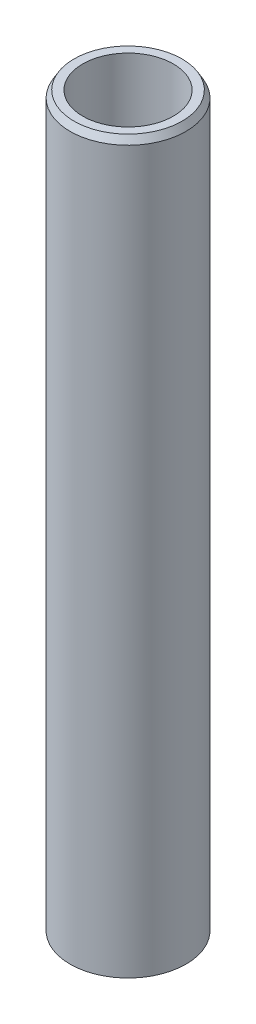
ISO-10303-21;
HEADER;
FILE_DESCRIPTION(('STEP AP214'),'2;1');
FILE_NAME('part.step','',(''),(''),'','','');
FILE_SCHEMA(('AUTOMOTIVE_DESIGN { 1 0 10303 214 1 1 1 1 }'));
ENDSEC;
DATA;
#1=APPLICATION_CONTEXT('core data for automotive mechanical design processes');
#2=APPLICATION_PROTOCOL_DEFINITION('international standard','automotive_design',2000,#1);
#3=PRODUCT_CONTEXT('',#1,'mechanical');
#4=PRODUCT('Part','Part','',(#3));
#5=PRODUCT_RELATED_PRODUCT_CATEGORY('part','',(#4));
#6=PRODUCT_DEFINITION_FORMATION('','',#4);
#7=PRODUCT_DEFINITION_CONTEXT('part definition',#1,'design');
#8=PRODUCT_DEFINITION('design','',#6,#7);
#9=PRODUCT_DEFINITION_SHAPE('','',#8);
#10=(LENGTH_UNIT() NAMED_UNIT(*) SI_UNIT(.MILLI.,.METRE.));
#11=(NAMED_UNIT(*) PLANE_ANGLE_UNIT() SI_UNIT($,.RADIAN.));
#12=(NAMED_UNIT(*) SI_UNIT($,.STERADIAN.) SOLID_ANGLE_UNIT());
#13=UNCERTAINTY_MEASURE_WITH_UNIT(LENGTH_MEASURE(1.E-05),#10,'distance_accuracy_value','');
#14=(GEOMETRIC_REPRESENTATION_CONTEXT(3) GLOBAL_UNCERTAINTY_ASSIGNED_CONTEXT((#13)) GLOBAL_UNIT_ASSIGNED_CONTEXT((#10,
#11,#12)) REPRESENTATION_CONTEXT('',''));
#15=CARTESIAN_POINT('',(0.,0.,0.));
#16=DIRECTION('',(0.,0.,1.));
#17=DIRECTION('',(1.,0.,0.));
#18=AXIS2_PLACEMENT_3D('',#15,#16,#17);
#19=CARTESIAN_POINT('',(0.,600.,0.));
#20=DIRECTION('',(0.,-1.,0.));
#21=DIRECTION('',(0.,0.,-1.));
#22=AXIS2_PLACEMENT_3D('',#19,#20,#21);
#23=CYLINDRICAL_SURFACE('',#22,47.5);
#24=CARTESIAN_POINT('',(0.,594.374029950717,0.));
#25=DIRECTION('',(0.,1.,0.));
#26=DIRECTION('',(0.,0.,1.));
#27=AXIS2_PLACEMENT_3D('',#24,#25,#26);
#28=CIRCLE('',#27,47.5);
#29=CARTESIAN_POINT('',(0.,594.374029950717,-47.5));
#30=VERTEX_POINT('',#29);
#31=EDGE_CURVE('E50',#30,#30,#28,.F.);
#32=CARTESIAN_POINT('',(0.,3.24815532240608,0.));
#33=DIRECTION('',(0.,1.,0.));
#34=DIRECTION('',(0.,0.,1.));
#35=AXIS2_PLACEMENT_3D('',#32,#33,#34);
#36=CIRCLE('',#35,47.5);
#37=CARTESIAN_POINT('',(0.,3.24815532240608,-47.5));
#38=VERTEX_POINT('',#37);
#39=EDGE_CURVE('E51',#38,#38,#36,.T.);
#40=CARTESIAN_POINT('',(0.,594.374029950717,-47.5));
#41=CARTESIAN_POINT('',(0.,588.216468756672,-47.5));
#42=CARTESIAN_POINT('',(0.,582.058907562628,-47.5));
#43=CARTESIAN_POINT('',(0.,569.743785174538,-47.5));
#44=CARTESIAN_POINT('',(0.,563.586223980493,-47.5));
#45=CARTESIAN_POINT('',(0.,551.271101592403,-47.5));
#46=CARTESIAN_POINT('',(0.,545.113540398358,-47.5));
#47=CARTESIAN_POINT('',(0.,532.798418010268,-47.5));
#48=CARTESIAN_POINT('',(0.,526.640856816223,-47.5));
#49=CARTESIAN_POINT('',(0.,514.325734428134,-47.5));
#50=CARTESIAN_POINT('',(0.,508.168173234089,-47.5));
#51=CARTESIAN_POINT('',(0.,495.853050845999,-47.5));
#52=CARTESIAN_POINT('',(0.,489.695489651954,-47.5));
#53=CARTESIAN_POINT('',(0.,477.380367263864,-47.5));
#54=CARTESIAN_POINT('',(0.,471.222806069819,-47.5));
#55=CARTESIAN_POINT('',(0.,458.907683681729,-47.5));
#56=CARTESIAN_POINT('',(0.,452.750122487685,-47.5));
#57=CARTESIAN_POINT('',(0.,440.435000099595,-47.5));
#58=CARTESIAN_POINT('',(0.,434.27743890555,-47.5));
#59=CARTESIAN_POINT('',(0.,421.96231651746,-47.5));
#60=CARTESIAN_POINT('',(0.,415.804755323415,-47.5));
#61=CARTESIAN_POINT('',(0.,403.489632935325,-47.5));
#62=CARTESIAN_POINT('',(0.,397.33207174128,-47.5));
#63=CARTESIAN_POINT('',(0.,385.01694935319,-47.5));
#64=CARTESIAN_POINT('',(0.,378.859388159146,-47.5));
#65=CARTESIAN_POINT('',(0.,366.544265771056,-47.5));
#66=CARTESIAN_POINT('',(0.,360.386704577011,-47.5));
#67=CARTESIAN_POINT('',(0.,348.071582188921,-47.5));
#68=CARTESIAN_POINT('',(0.,341.914020994876,-47.5));
#69=CARTESIAN_POINT('',(0.,329.598898606786,-47.5));
#70=CARTESIAN_POINT('',(0.,323.441337412741,-47.5));
#71=CARTESIAN_POINT('',(0.,311.126215024652,-47.5));
#72=CARTESIAN_POINT('',(0.,304.968653830607,-47.5));
#73=CARTESIAN_POINT('',(0.,292.653531442517,-47.5));
#74=CARTESIAN_POINT('',(0.,286.495970248472,-47.5));
#75=CARTESIAN_POINT('',(0.,274.180847860382,-47.5));
#76=CARTESIAN_POINT('',(0.,268.023286666337,-47.5));
#77=CARTESIAN_POINT('',(0.,255.708164278247,-47.5));
#78=CARTESIAN_POINT('',(0.,249.550603084202,-47.5));
#79=CARTESIAN_POINT('',(0.,237.235480696113,-47.5));
#80=CARTESIAN_POINT('',(0.,231.077919502068,-47.5));
#81=CARTESIAN_POINT('',(0.,218.762797113978,-47.5));
#82=CARTESIAN_POINT('',(0.,212.605235919933,-47.5));
#83=CARTESIAN_POINT('',(0.,200.290113531843,-47.5));
#84=CARTESIAN_POINT('',(0.,194.132552337798,-47.5));
#85=CARTESIAN_POINT('',(0.,181.817429949708,-47.5));
#86=CARTESIAN_POINT('',(0.,175.659868755664,-47.5));
#87=CARTESIAN_POINT('',(0.,163.344746367574,-47.5));
#88=CARTESIAN_POINT('',(0.,157.187185173529,-47.5));
#89=CARTESIAN_POINT('',(0.,144.872062785439,-47.5));
#90=CARTESIAN_POINT('',(0.,138.714501591394,-47.5));
#91=CARTESIAN_POINT('',(0.,126.399379203304,-47.5));
#92=CARTESIAN_POINT('',(0.,120.241818009259,-47.5));
#93=CARTESIAN_POINT('',(0.,107.92669562117,-47.5));
#94=CARTESIAN_POINT('',(0.,101.769134427125,-47.5));
#95=CARTESIAN_POINT('',(0.,89.4540120390349,-47.5));
#96=CARTESIAN_POINT('',(0.,83.2964508449899,-47.5));
#97=CARTESIAN_POINT('',(0.,70.9813284569,-47.5));
#98=CARTESIAN_POINT('',(0.,64.8237672628551,-47.5));
#99=CARTESIAN_POINT('',(0.,52.5086448747653,-47.5));
#100=CARTESIAN_POINT('',(0.,46.3510836807204,-47.5));
#101=CARTESIAN_POINT('',(0.,34.0359612926306,-47.5));
#102=CARTESIAN_POINT('',(0.,27.8784000985857,-47.5));
#103=CARTESIAN_POINT('',(0.,15.5632777104959,-47.5));
#104=CARTESIAN_POINT('',(0.,9.40571651645097,-47.5));
#105=CARTESIAN_POINT('',(0.,3.24815532240608,-47.5));
#106=B_SPLINE_CURVE_WITH_KNOTS('',3,(#40,#41,#42,#43,#44,#45,#46,#47,#48,#49,#50,#51,#52,#53,
#54,#55,#56,#57,#58,#59,#60,#61,#62,#63,#64,#65,#66,#67,#68,#69,#70,#71,#72,#73,#74,#75,#76,#77,
#78,#79,#80,#81,#82,#83,#84,#85,#86,#87,#88,#89,#90,#91,#92,#93,#94,#95,#96,#97,#98,#99,#100,
#101,#102,#103,#104,#105),.UNSPECIFIED.,.F.,.F.,(4,2,2,2,2,2,2,2,2,2,2,2,2,2,2,2,2,2,2,2,2,2,2,
2,2,2,2,2,2,2,2,2,4),(0.,18.4726835821348,36.9453671642695,55.4180507464043,73.890734328539,
92.3634179106737,110.836101492808,129.308785074943,147.781468657078,166.254152239213,
184.726835821347,203.199519403482,221.672202985617,240.144886567751,258.617570149886,
277.090253732021,295.562937314156,314.03562089629,332.508304478425,350.98098806056,
369.453671642695,387.926355224829,406.399038806964,424.871722389099,443.344405971233,
461.817089553368,480.289773135503,498.762456717638,517.235140299772,535.707823881907,
554.180507464042,572.653191046177,591.125874628311),.UNSPECIFIED.);
#107=EDGE_CURVE('BSEAM39',#30,#38,#106,.T.);
#108=ORIENTED_EDGE('',*,*,#31,.T.);
#109=ORIENTED_EDGE('',*,*,#39,.T.);
#110=ORIENTED_EDGE('',*,*,#107,.T.);
#111=ORIENTED_EDGE('',*,*,#107,.F.);
#112=EDGE_LOOP('',(#108,#110,#109,#111));
#113=FACE_BOUND('',#112,.T.);
#114=ADVANCED_FACE('F39',(#113),#23,.T.);
#115=CARTESIAN_POINT('',(0.,600.,0.));
#116=DIRECTION('',(0.,1.,0.));
#117=DIRECTION('',(0.,0.,1.));
#118=AXIS2_PLACEMENT_3D('',#115,#116,#117);
#119=PLANE('',#118);
#120=CARTESIAN_POINT('',(0.,600.,0.));
#121=DIRECTION('',(0.,1.,0.));
#122=DIRECTION('',(0.,0.,1.));
#123=AXIS2_PLACEMENT_3D('',#120,#121,#122);
#124=CIRCLE('',#123,44.251844677594);
#125=CARTESIAN_POINT('',(0.,600.,-44.2518446775941));
#126=VERTEX_POINT('',#125);
#127=EDGE_CURVE('E54',#126,#126,#124,.T.);
#128=ORIENTED_EDGE('',*,*,#127,.T.);
#129=EDGE_LOOP('',(#128));
#130=FACE_BOUND('',#129,.T.);
#131=CARTESIAN_POINT('',(0.,600.,0.));
#132=DIRECTION('',(0.,1.,0.));
#133=DIRECTION('',(0.,0.,1.));
#134=AXIS2_PLACEMENT_3D('',#131,#132,#133);
#135=CIRCLE('',#134,37.147316009326);
#136=CARTESIAN_POINT('',(0.,600.,37.147316009326));
#137=VERTEX_POINT('',#136);
#138=EDGE_CURVE('E58',#137,#137,#135,.T.);
#139=ORIENTED_EDGE('',*,*,#138,.F.);
#140=EDGE_LOOP('',(#139));
#141=FACE_BOUND('',#140,.T.);
#142=ADVANCED_FACE('F69',(#130,#141),#119,.T.);
#143=CARTESIAN_POINT('',(0.,0.,0.));
#144=DIRECTION('',(0.,1.,0.));
#145=DIRECTION('',(0.,0.,1.));
#146=AXIS2_PLACEMENT_3D('',#143,#144,#145);
#147=PLANE('',#146);
#148=CARTESIAN_POINT('',(0.,0.,0.));
#149=DIRECTION('',(0.,1.,0.));
#150=DIRECTION('',(0.,0.,1.));
#151=AXIS2_PLACEMENT_3D('',#148,#149,#150);
#152=CIRCLE('',#151,41.8740299507174);
#153=CARTESIAN_POINT('',(0.,0.,41.8740299507174));
#154=VERTEX_POINT('',#153);
#155=EDGE_CURVE('E10',#154,#154,#152,.F.);
#156=ORIENTED_EDGE('',*,*,#155,.T.);
#157=EDGE_LOOP('',(#156));
#158=FACE_BOUND('',#157,.T.);
#159=CARTESIAN_POINT('',(0.,0.,0.));
#160=DIRECTION('',(0.,1.,0.));
#161=DIRECTION('',(0.,0.,1.));
#162=AXIS2_PLACEMENT_3D('',#159,#160,#161);
#163=CIRCLE('',#162,37.147316009326);
#164=CARTESIAN_POINT('',(0.,0.,37.147316009326));
#165=VERTEX_POINT('',#164);
#166=EDGE_CURVE('E63',#165,#165,#163,.T.);
#167=ORIENTED_EDGE('',*,*,#166,.T.);
#168=EDGE_LOOP('',(#167));
#169=FACE_BOUND('',#168,.T.);
#170=ADVANCED_FACE('F75',(#158,#169),#147,.F.);
#171=CARTESIAN_POINT('',(0.,600.,0.));
#172=DIRECTION('',(0.,-1.,0.));
#173=DIRECTION('',(0.,0.,-1.));
#174=AXIS2_PLACEMENT_3D('',#171,#172,#173);
#175=CYLINDRICAL_SURFACE('',#174,37.147316009326);
#176=ORIENTED_EDGE('',*,*,#138,.T.);
#177=EDGE_LOOP('',(#176));
#178=FACE_BOUND('',#177,.T.);
#179=ORIENTED_EDGE('',*,*,#166,.F.);
#180=EDGE_LOOP('',(#179));
#181=FACE_BOUND('',#180,.T.);
#182=ADVANCED_FACE('F70',(#178,#181),#175,.F.);
#183=CARTESIAN_POINT('',(0.,600.,0.));
#184=DIRECTION('',(0.,-1.,0.));
#185=DIRECTION('',(0.,0.,-1.));
#186=AXIS2_PLACEMENT_3D('',#183,#184,#185);
#187=CONICAL_SURFACE('',#186,44.251844677594,0.523598775598289);
#188=CARTESIAN_POINT('',(0.,594.374029950717,-47.5));
#189=CARTESIAN_POINT('',(0.,594.432633805397,-47.466165048725));
#190=CARTESIAN_POINT('',(0.,594.491237660077,-47.4323300974499));
#191=CARTESIAN_POINT('',(0.,594.608445369438,-47.3646601948998));
#192=CARTESIAN_POINT('',(0.,594.667049224117,-47.3308252436247));
#193=CARTESIAN_POINT('',(0.,594.784256933478,-47.2631553410746));
#194=CARTESIAN_POINT('',(0.,594.842860788158,-47.2293203897995));
#195=CARTESIAN_POINT('',(0.,594.960068497518,-47.1616504872494));
#196=CARTESIAN_POINT('',(0.,595.018672352198,-47.1278155359743));
#197=CARTESIAN_POINT('',(0.,595.135880061558,-47.0601456334242));
#198=CARTESIAN_POINT('',(0.,595.194483916238,-47.0263106821492));
#199=CARTESIAN_POINT('',(0.,595.311691625598,-46.9586407795991));
#200=CARTESIAN_POINT('',(0.,595.370295480278,-46.924805828324));
#201=CARTESIAN_POINT('',(0.,595.487503189638,-46.8571359257738));
#202=CARTESIAN_POINT('',(0.,595.546107044318,-46.8233009744988));
#203=CARTESIAN_POINT('',(0.,595.663314753678,-46.7556310719487));
#204=CARTESIAN_POINT('',(0.,595.721918608358,-46.7217961206736));
#205=CARTESIAN_POINT('',(0.,595.839126317718,-46.6541262181235));
#206=CARTESIAN_POINT('',(0.,595.897730172398,-46.6202912668484));
#207=CARTESIAN_POINT('',(0.,596.014937881758,-46.5526213642983));
#208=CARTESIAN_POINT('',(0.,596.073541736438,-46.5187864130232));
#209=CARTESIAN_POINT('',(0.,596.190749445798,-46.4511165104731));
#210=CARTESIAN_POINT('',(0.,596.249353300478,-46.4172815591981));
#211=CARTESIAN_POINT('',(0.,596.366561009838,-46.3496116566479));
#212=CARTESIAN_POINT('',(0.,596.425164864518,-46.3157767053729));
#213=CARTESIAN_POINT('',(0.,596.542372573878,-46.2481068028227));
#214=CARTESIAN_POINT('',(0.,596.600976428558,-46.2142718515477));
#215=CARTESIAN_POINT('',(0.,596.718184137918,-46.1466019489975));
#216=CARTESIAN_POINT('',(0.,596.776787992598,-46.1127669977225));
#217=CARTESIAN_POINT('',(0.,596.893995701959,-46.0450970951724));
#218=CARTESIAN_POINT('',(0.,596.952599556638,-46.0112621438973));
#219=CARTESIAN_POINT('',(0.,597.069807265999,-45.9435922413472));
#220=CARTESIAN_POINT('',(0.,597.128411120679,-45.9097572900721));
#221=CARTESIAN_POINT('',(0.,597.245618830039,-45.842087387522));
#222=CARTESIAN_POINT('',(0.,597.304222684719,-45.8082524362469));
#223=CARTESIAN_POINT('',(0.,597.421430394079,-45.7405825336968));
#224=CARTESIAN_POINT('',(0.,597.480034248759,-45.7067475824217));
#225=CARTESIAN_POINT('',(0.,597.597241958119,-45.6390776798716));
#226=CARTESIAN_POINT('',(0.,597.655845812799,-45.6052427285965));
#227=CARTESIAN_POINT('',(0.,597.773053522159,-45.5375728260464));
#228=CARTESIAN_POINT('',(0.,597.831657376839,-45.5037378747714));
#229=CARTESIAN_POINT('',(0.,597.948865086199,-45.4360679722212));
#230=CARTESIAN_POINT('',(0.,598.007468940879,-45.4022330209462));
#231=CARTESIAN_POINT('',(0.,598.124676650239,-45.334563118396));
#232=CARTESIAN_POINT('',(0.,598.183280504919,-45.300728167121));
#233=CARTESIAN_POINT('',(0.,598.300488214279,-45.2330582645709));
#234=CARTESIAN_POINT('',(0.,598.359092068959,-45.1992233132958));
#235=CARTESIAN_POINT('',(0.,598.476299778319,-45.1315534107457));
#236=CARTESIAN_POINT('',(0.,598.534903632999,-45.0977184594706));
#237=CARTESIAN_POINT('',(0.,598.652111342359,-45.0300485569205));
#238=CARTESIAN_POINT('',(0.,598.710715197039,-44.9962136056454));
#239=CARTESIAN_POINT('',(0.,598.827922906399,-44.9285437030953));
#240=CARTESIAN_POINT('',(0.,598.886526761079,-44.8947087518203));
#241=CARTESIAN_POINT('',(0.,599.00373447044,-44.8270388492701));
#242=CARTESIAN_POINT('',(0.,599.062338325119,-44.793203897995));
#243=CARTESIAN_POINT('',(0.,599.17954603448,-44.7255339954449));
#244=CARTESIAN_POINT('',(0.,599.23814988916,-44.6916990441699));
#245=CARTESIAN_POINT('',(0.,599.35535759852,-44.6240291416197));
#246=CARTESIAN_POINT('',(0.,599.4139614532,-44.5901941903447));
#247=CARTESIAN_POINT('',(0.,599.53116916256,-44.5225242877946));
#248=CARTESIAN_POINT('',(0.,599.58977301724,-44.4886893365195));
#249=CARTESIAN_POINT('',(0.,599.7069807266,-44.4210194339694));
#250=CARTESIAN_POINT('',(0.,599.76558458128,-44.3871844826943));
#251=CARTESIAN_POINT('',(0.,599.88279229064,-44.3195145801442));
#252=CARTESIAN_POINT('',(0.,599.94139614532,-44.2856796288691));
#253=CARTESIAN_POINT('',(0.,600.,-44.2518446775941));
#254=B_SPLINE_CURVE_WITH_KNOTS('',3,(#188,#189,#190,#191,#192,#193,#194,#195,#196,#197,#198,
#199,#200,#201,#202,#203,#204,#205,#206,#207,#208,#209,#210,#211,#212,#213,#214,#215,#216,#217,
#218,#219,#220,#221,#222,#223,#224,#225,#226,#227,#228,#229,#230,#231,#232,#233,#234,#235,#236,
#237,#238,#239,#240,#241,#242,#243,#244,#245,#246,#247,#248,#249,#250,#251,#252,#253),
.UNSPECIFIED.,.F.,.F.,(4,2,2,2,2,2,2,2,2,2,2,2,2,2,2,2,2,2,2,2,2,2,2,2,2,2,2,2,2,2,2,2,4),(0.,
0.20300970765041,0.40601941530082,0.609029122951138,0.812038830601548,1.01504853825196,
1.21805824590227,1.42106795355268,1.62407766120309,1.82708736885341,2.03009707650382,
2.23310678415423,2.43611649180454,2.63912619945495,2.84213590710536,3.04514561475568,
3.24815532240609,3.4511650300565,3.65417473770681,3.85718444535722,4.06019415300763,
4.26320386065795,4.46621356830836,4.66922327595877,4.87223298360908,5.07524269125949,
5.27825239890991,5.48126210656022,5.68427181421063,5.88728152186104,6.09029122951135,
6.29330093716176,6.49631064481217),.UNSPECIFIED.);
#255=EDGE_CURVE('BSEAM81',#30,#126,#254,.T.);
#256=ORIENTED_EDGE('',*,*,#31,.F.);
#257=ORIENTED_EDGE('',*,*,#127,.F.);
#258=ORIENTED_EDGE('',*,*,#255,.T.);
#259=ORIENTED_EDGE('',*,*,#255,.F.);
#260=EDGE_LOOP('',(#256,#258,#257,#259));
#261=FACE_BOUND('',#260,.T.);
#262=ADVANCED_FACE('F81',(#261),#187,.T.);
#263=CARTESIAN_POINT('',(0.,3.24815532240608,0.));
#264=DIRECTION('',(0.,1.,0.));
#265=DIRECTION('',(0.,0.,1.));
#266=AXIS2_PLACEMENT_3D('',#263,#264,#265);
#267=CONICAL_SURFACE('',#266,47.5,1.0471975511966);
#268=ORIENTED_EDGE('',*,*,#155,.F.);
#269=EDGE_LOOP('',(#268));
#270=FACE_BOUND('',#269,.T.);
#271=ORIENTED_EDGE('',*,*,#39,.F.);
#272=EDGE_LOOP('',(#271));
#273=FACE_BOUND('',#272,.T.);
#274=ADVANCED_FACE('F45',(#270,#273),#267,.T.);
#275=CLOSED_SHELL('',(#114,#142,#170,#182,#262,#274));
#276=MANIFOLD_SOLID_BREP('B2',#275);
#277=ADVANCED_BREP_SHAPE_REPRESENTATION('',(#18,#276),#14);
#278=SHAPE_DEFINITION_REPRESENTATION(#9,#277);
ENDSEC;
END-ISO-10303-21;
